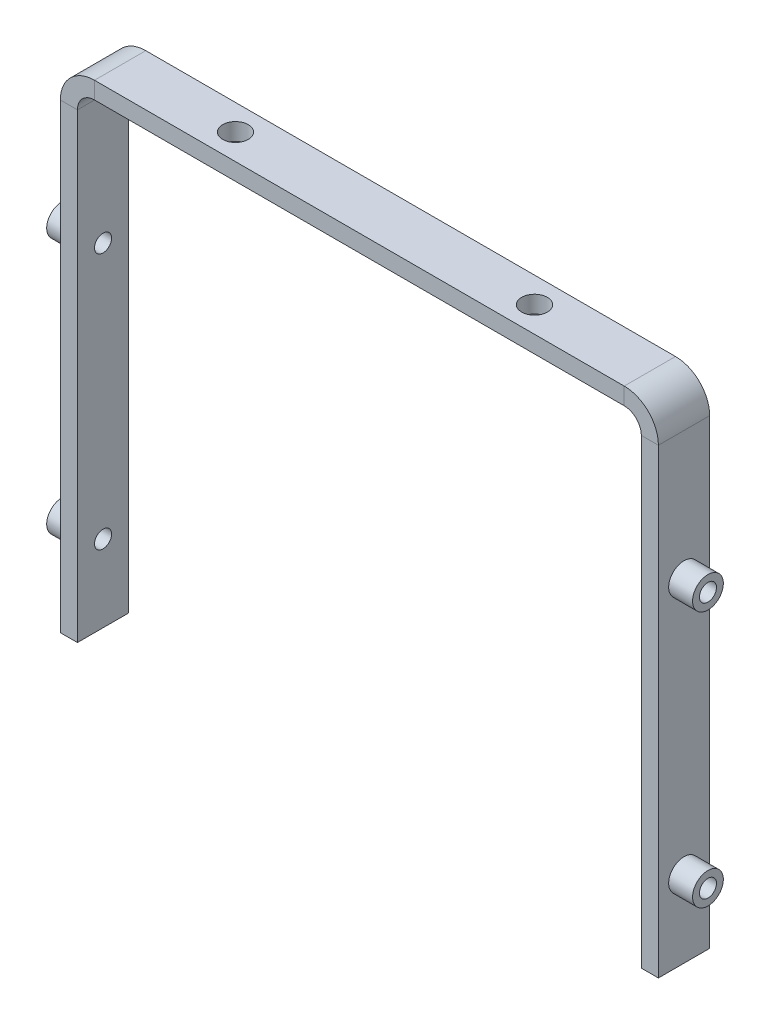
ISO-10303-21;
HEADER;
FILE_DESCRIPTION(('STEP AP214'),'2;1');
FILE_NAME('part.step','',(''),(''),'','','');
FILE_SCHEMA(('AUTOMOTIVE_DESIGN { 1 0 10303 214 1 1 1 1 }'));
ENDSEC;
DATA;
#1=APPLICATION_CONTEXT('core data for automotive mechanical design processes');
#2=APPLICATION_PROTOCOL_DEFINITION('international standard','automotive_design',2000,#1);
#3=PRODUCT_CONTEXT('',#1,'mechanical');
#4=PRODUCT('Part','Part','',(#3));
#5=PRODUCT_RELATED_PRODUCT_CATEGORY('part','',(#4));
#6=PRODUCT_DEFINITION_FORMATION('','',#4);
#7=PRODUCT_DEFINITION_CONTEXT('part definition',#1,'design');
#8=PRODUCT_DEFINITION('design','',#6,#7);
#9=PRODUCT_DEFINITION_SHAPE('','',#8);
#10=(LENGTH_UNIT() NAMED_UNIT(*) SI_UNIT(.MILLI.,.METRE.));
#11=(NAMED_UNIT(*) PLANE_ANGLE_UNIT() SI_UNIT($,.RADIAN.));
#12=(NAMED_UNIT(*) SI_UNIT($,.STERADIAN.) SOLID_ANGLE_UNIT());
#13=UNCERTAINTY_MEASURE_WITH_UNIT(LENGTH_MEASURE(1.E-05),#10,'distance_accuracy_value','');
#14=(GEOMETRIC_REPRESENTATION_CONTEXT(3) GLOBAL_UNCERTAINTY_ASSIGNED_CONTEXT((#13)) GLOBAL_UNIT_ASSIGNED_CONTEXT((#10,
#11,#12)) REPRESENTATION_CONTEXT('',''));
#15=CARTESIAN_POINT('',(0.,0.,0.));
#16=DIRECTION('',(0.,0.,1.));
#17=DIRECTION('',(1.,0.,0.));
#18=AXIS2_PLACEMENT_3D('',#15,#16,#17);
#19=CARTESIAN_POINT('',(175.,-280.,15.));
#20=DIRECTION('',(1.,0.,0.));
#21=DIRECTION('',(0.,1.,0.));
#22=AXIS2_PLACEMENT_3D('',#19,#20,#21);
#23=PLANE('',#22);
#24=CARTESIAN_POINT('',(175.,-235.,0.));
#25=DIRECTION('',(1.,0.,0.));
#26=DIRECTION('',(0.,1.,0.));
#27=AXIS2_PLACEMENT_3D('',#24,#25,#26);
#28=CIRCLE('',#27,9.00000000000001);
#29=CARTESIAN_POINT('',(175.,-226.,0.));
#30=VERTEX_POINT('',#29);
#31=EDGE_CURVE('E393',#30,#30,#28,.T.);
#32=ORIENTED_EDGE('',*,*,#31,.F.);
#33=EDGE_LOOP('',(#32));
#34=FACE_BOUND('',#33,.T.);
#35=DIRECTION('',(0.,1.,0.));
#36=VECTOR('',#35,1.);
#37=CARTESIAN_POINT('',(175.,-280.,-15.));
#38=LINE('',#37,#36);
#39=CARTESIAN_POINT('',(175.,-9.99999999999998,-15.));
#40=VERTEX_POINT('',#39);
#41=CARTESIAN_POINT('',(175.,-280.,-15.));
#42=VERTEX_POINT('',#41);
#43=EDGE_CURVE('E119',#40,#42,#38,.F.);
#44=ORIENTED_EDGE('',*,*,#43,.F.);
#45=DIRECTION('',(0.,0.,1.));
#46=VECTOR('',#45,1.);
#47=CARTESIAN_POINT('',(175.,-9.99999999999995,15.));
#48=LINE('',#47,#46);
#49=CARTESIAN_POINT('',(175.,-9.99999999999995,15.));
#50=VERTEX_POINT('',#49);
#51=EDGE_CURVE('E214',#50,#40,#48,.F.);
#52=ORIENTED_EDGE('',*,*,#51,.F.);
#53=DIRECTION('',(0.,1.,0.));
#54=VECTOR('',#53,1.);
#55=CARTESIAN_POINT('',(175.,-280.,15.));
#56=LINE('',#55,#54);
#57=CARTESIAN_POINT('',(175.,-280.,15.));
#58=VERTEX_POINT('',#57);
#59=EDGE_CURVE('E121',#50,#58,#56,.F.);
#60=ORIENTED_EDGE('',*,*,#59,.T.);
#61=DIRECTION('',(0.,0.,1.));
#62=VECTOR('',#61,1.);
#63=CARTESIAN_POINT('',(175.,-280.,15.));
#64=LINE('',#63,#62);
#65=EDGE_CURVE('E104',#58,#42,#64,.F.);
#66=ORIENTED_EDGE('',*,*,#65,.T.);
#67=EDGE_LOOP('',(#44,#52,#60,#66));
#68=FACE_BOUND('',#67,.T.);
#69=CARTESIAN_POINT('',(175.,-84.9999999999999,0.));
#70=DIRECTION('',(1.,0.,0.));
#71=DIRECTION('',(0.,1.,0.));
#72=AXIS2_PLACEMENT_3D('',#69,#70,#71);
#73=CIRCLE('',#72,9.00000000000001);
#74=CARTESIAN_POINT('',(175.,-75.9999999999999,0.));
#75=VERTEX_POINT('',#74);
#76=EDGE_CURVE('E384',#75,#75,#73,.T.);
#77=ORIENTED_EDGE('',*,*,#76,.F.);
#78=EDGE_LOOP('',(#77));
#79=FACE_BOUND('',#78,.T.);
#80=ADVANCED_FACE('F41',(#34,#68,#79),#23,.T.);
#81=CARTESIAN_POINT('',(165.,-280.,15.));
#82=DIRECTION('',(0.,-1.,0.));
#83=DIRECTION('',(0.,0.,-1.));
#84=AXIS2_PLACEMENT_3D('',#81,#82,#83);
#85=PLANE('',#84);
#86=DIRECTION('',(-1.,0.,0.));
#87=VECTOR('',#86,1.);
#88=CARTESIAN_POINT('',(165.,-280.,-15.));
#89=LINE('',#88,#87);
#90=CARTESIAN_POINT('',(165.,-280.,-15.));
#91=VERTEX_POINT('',#90);
#92=EDGE_CURVE('E100',#42,#91,#89,.T.);
#93=ORIENTED_EDGE('',*,*,#92,.F.);
#94=ORIENTED_EDGE('',*,*,#65,.F.);
#95=DIRECTION('',(-1.,0.,0.));
#96=VECTOR('',#95,1.);
#97=CARTESIAN_POINT('',(165.,-280.,15.));
#98=LINE('',#97,#96);
#99=CARTESIAN_POINT('',(165.,-280.,15.));
#100=VERTEX_POINT('',#99);
#101=EDGE_CURVE('E112',#58,#100,#98,.T.);
#102=ORIENTED_EDGE('',*,*,#101,.T.);
#103=DIRECTION('',(0.,0.,-1.));
#104=VECTOR('',#103,1.);
#105=CARTESIAN_POINT('',(165.,-280.,15.));
#106=LINE('',#105,#104);
#107=EDGE_CURVE('E107',#100,#91,#106,.T.);
#108=ORIENTED_EDGE('',*,*,#107,.T.);
#109=EDGE_LOOP('',(#93,#94,#102,#108));
#110=FACE_BOUND('',#109,.T.);
#111=ADVANCED_FACE('F102',(#110),#85,.T.);
#112=CARTESIAN_POINT('',(165.,-280.,15.));
#113=DIRECTION('',(0.,0.,1.));
#114=DIRECTION('',(0.,-1.,0.));
#115=AXIS2_PLACEMENT_3D('',#112,#113,#114);
#116=PLANE('',#115);
#117=ORIENTED_EDGE('',*,*,#101,.F.);
#118=ORIENTED_EDGE('',*,*,#59,.F.);
#119=DIRECTION('',(-1.,0.,0.));
#120=VECTOR('',#119,1.);
#121=CARTESIAN_POINT('',(165.,-9.99999999999998,15.));
#122=LINE('',#121,#120);
#123=CARTESIAN_POINT('',(165.,-9.99999999999998,15.));
#124=VERTEX_POINT('',#123);
#125=EDGE_CURVE('E164',#50,#124,#122,.T.);
#126=ORIENTED_EDGE('',*,*,#125,.T.);
#127=DIRECTION('',(0.,-1.,0.));
#128=VECTOR('',#127,1.);
#129=CARTESIAN_POINT('',(165.,-280.,15.));
#130=LINE('',#129,#128);
#131=EDGE_CURVE('E276',#124,#100,#130,.T.);
#132=ORIENTED_EDGE('',*,*,#131,.T.);
#133=EDGE_LOOP('',(#117,#118,#126,#132));
#134=FACE_BOUND('',#133,.T.);
#135=ADVANCED_FACE('F279',(#134),#116,.T.);
#136=CARTESIAN_POINT('',(155.,-9.99999999999998,15.));
#137=DIRECTION('',(0.,0.,1.));
#138=DIRECTION('',(1.,0.,0.));
#139=AXIS2_PLACEMENT_3D('',#136,#137,#138);
#140=PLANE('',#139);
#141=ORIENTED_EDGE('',*,*,#125,.F.);
#142=CARTESIAN_POINT('',(155.,-9.99999999999998,15.));
#143=DIRECTION('',(0.,0.,-1.));
#144=DIRECTION('',(-1.,0.,0.));
#145=AXIS2_PLACEMENT_3D('',#142,#143,#144);
#146=CIRCLE('',#145,20.);
#147=CARTESIAN_POINT('',(155.,9.99999999999996,15.));
#148=VERTEX_POINT('',#147);
#149=EDGE_CURVE('E210',#148,#50,#146,.T.);
#150=ORIENTED_EDGE('',*,*,#149,.F.);
#151=DIRECTION('',(0.,-1.,0.));
#152=VECTOR('',#151,1.);
#153=CARTESIAN_POINT('',(155.,0.,15.));
#154=LINE('',#153,#152);
#155=CARTESIAN_POINT('',(155.,0.,15.));
#156=VERTEX_POINT('',#155);
#157=EDGE_CURVE('E161',#148,#156,#154,.T.);
#158=ORIENTED_EDGE('',*,*,#157,.T.);
#159=CARTESIAN_POINT('',(155.,-9.99999999999998,15.));
#160=DIRECTION('',(0.,0.,-1.));
#161=DIRECTION('',(1.,0.,0.));
#162=AXIS2_PLACEMENT_3D('',#159,#160,#161);
#163=CIRCLE('',#162,10.);
#164=EDGE_CURVE('E167',#156,#124,#163,.T.);
#165=ORIENTED_EDGE('',*,*,#164,.T.);
#166=EDGE_LOOP('',(#141,#150,#158,#165));
#167=FACE_BOUND('',#166,.T.);
#168=ADVANCED_FACE('F253',(#167),#140,.T.);
#169=CARTESIAN_POINT('',(155.,0.,15.));
#170=DIRECTION('',(0.,0.,1.));
#171=DIRECTION('',(1.,0.,0.));
#172=AXIS2_PLACEMENT_3D('',#169,#170,#171);
#173=PLANE('',#172);
#174=ORIENTED_EDGE('',*,*,#157,.F.);
#175=DIRECTION('',(-1.,0.,0.));
#176=VECTOR('',#175,1.);
#177=CARTESIAN_POINT('',(155.,9.99999999999996,15.));
#178=LINE('',#177,#176);
#179=CARTESIAN_POINT('',(-155.,9.99999999999998,15.));
#180=VERTEX_POINT('',#179);
#181=EDGE_CURVE('E206',#180,#148,#178,.F.);
#182=ORIENTED_EDGE('',*,*,#181,.F.);
#183=DIRECTION('',(0.,-1.,0.));
#184=VECTOR('',#183,1.);
#185=CARTESIAN_POINT('',(-155.,0.,15.));
#186=LINE('',#185,#184);
#187=CARTESIAN_POINT('',(-155.,0.,15.));
#188=VERTEX_POINT('',#187);
#189=EDGE_CURVE('E158',#180,#188,#186,.T.);
#190=ORIENTED_EDGE('',*,*,#189,.T.);
#191=DIRECTION('',(1.,0.,0.));
#192=VECTOR('',#191,1.);
#193=CARTESIAN_POINT('',(155.,0.,15.));
#194=LINE('',#193,#192);
#195=EDGE_CURVE('E407',#188,#156,#194,.T.);
#196=ORIENTED_EDGE('',*,*,#195,.T.);
#197=EDGE_LOOP('',(#174,#182,#190,#196));
#198=FACE_BOUND('',#197,.T.);
#199=ADVANCED_FACE('F247',(#198),#173,.T.);
#200=CARTESIAN_POINT('',(-155.,-10.,15.));
#201=DIRECTION('',(0.,0.,1.));
#202=DIRECTION('',(1.,0.,0.));
#203=AXIS2_PLACEMENT_3D('',#200,#201,#202);
#204=PLANE('',#203);
#205=ORIENTED_EDGE('',*,*,#189,.F.);
#206=CARTESIAN_POINT('',(-155.,-10.,15.));
#207=DIRECTION('',(0.,0.,-1.));
#208=DIRECTION('',(-1.,0.,0.));
#209=AXIS2_PLACEMENT_3D('',#206,#207,#208);
#210=CIRCLE('',#209,20.);
#211=CARTESIAN_POINT('',(-175.,-10.,15.));
#212=VERTEX_POINT('',#211);
#213=EDGE_CURVE('E125',#212,#180,#210,.T.);
#214=ORIENTED_EDGE('',*,*,#213,.F.);
#215=DIRECTION('',(1.,0.,0.));
#216=VECTOR('',#215,1.);
#217=CARTESIAN_POINT('',(-165.,-10.,15.));
#218=LINE('',#217,#216);
#219=CARTESIAN_POINT('',(-165.,-10.,15.));
#220=VERTEX_POINT('',#219);
#221=EDGE_CURVE('E155',#212,#220,#218,.T.);
#222=ORIENTED_EDGE('',*,*,#221,.T.);
#223=CARTESIAN_POINT('',(-155.,-10.,15.));
#224=DIRECTION('',(0.,0.,-1.));
#225=DIRECTION('',(-1.,0.,0.));
#226=AXIS2_PLACEMENT_3D('',#223,#224,#225);
#227=CIRCLE('',#226,9.99999999999998);
#228=EDGE_CURVE('E429',#220,#188,#227,.T.);
#229=ORIENTED_EDGE('',*,*,#228,.T.);
#230=EDGE_LOOP('',(#205,#214,#222,#229));
#231=FACE_BOUND('',#230,.T.);
#232=ADVANCED_FACE('F333',(#231),#204,.T.);
#233=CARTESIAN_POINT('',(-165.,-280.,15.));
#234=DIRECTION('',(0.,0.,1.));
#235=DIRECTION('',(0.,1.,0.));
#236=AXIS2_PLACEMENT_3D('',#233,#234,#235);
#237=PLANE('',#236);
#238=ORIENTED_EDGE('',*,*,#221,.F.);
#239=DIRECTION('',(0.,-1.,0.));
#240=VECTOR('',#239,1.);
#241=CARTESIAN_POINT('',(-175.,-280.,15.));
#242=LINE('',#241,#240);
#243=CARTESIAN_POINT('',(-175.,-280.,15.));
#244=VERTEX_POINT('',#243);
#245=EDGE_CURVE('E200',#244,#212,#242,.F.);
#246=ORIENTED_EDGE('',*,*,#245,.F.);
#247=DIRECTION('',(1.,0.,0.));
#248=VECTOR('',#247,1.);
#249=CARTESIAN_POINT('',(-165.,-280.,15.));
#250=LINE('',#249,#248);
#251=CARTESIAN_POINT('',(-165.,-280.,15.));
#252=VERTEX_POINT('',#251);
#253=EDGE_CURVE('E152',#244,#252,#250,.T.);
#254=ORIENTED_EDGE('',*,*,#253,.T.);
#255=DIRECTION('',(0.,1.,0.));
#256=VECTOR('',#255,1.);
#257=CARTESIAN_POINT('',(-165.,-280.,15.));
#258=LINE('',#257,#256);
#259=EDGE_CURVE('E422',#252,#220,#258,.T.);
#260=ORIENTED_EDGE('',*,*,#259,.T.);
#261=EDGE_LOOP('',(#238,#246,#254,#260));
#262=FACE_BOUND('',#261,.T.);
#263=ADVANCED_FACE('F330',(#262),#237,.T.);
#264=CARTESIAN_POINT('',(-165.,-280.,15.));
#265=DIRECTION('',(0.,1.,0.));
#266=DIRECTION('',(0.,0.,-1.));
#267=AXIS2_PLACEMENT_3D('',#264,#265,#266);
#268=PLANE('',#267);
#269=ORIENTED_EDGE('',*,*,#253,.F.);
#270=DIRECTION('',(0.,0.,1.));
#271=VECTOR('',#270,1.);
#272=CARTESIAN_POINT('',(-175.,-280.,15.));
#273=LINE('',#272,#271);
#274=CARTESIAN_POINT('',(-175.,-280.,-15.));
#275=VERTEX_POINT('',#274);
#276=EDGE_CURVE('E187',#244,#275,#273,.F.);
#277=ORIENTED_EDGE('',*,*,#276,.T.);
#278=DIRECTION('',(1.,0.,0.));
#279=VECTOR('',#278,1.);
#280=CARTESIAN_POINT('',(-165.,-280.,-15.));
#281=LINE('',#280,#279);
#282=CARTESIAN_POINT('',(-165.,-280.,-15.));
#283=VERTEX_POINT('',#282);
#284=EDGE_CURVE('E149',#275,#283,#281,.T.);
#285=ORIENTED_EDGE('',*,*,#284,.T.);
#286=DIRECTION('',(0.,0.,-1.));
#287=VECTOR('',#286,1.);
#288=CARTESIAN_POINT('',(-165.,-280.,15.));
#289=LINE('',#288,#287);
#290=EDGE_CURVE('E425',#252,#283,#289,.T.);
#291=ORIENTED_EDGE('',*,*,#290,.F.);
#292=EDGE_LOOP('',(#269,#277,#285,#291));
#293=FACE_BOUND('',#292,.T.);
#294=ADVANCED_FACE('F196',(#293),#268,.F.);
#295=CARTESIAN_POINT('',(-165.,-280.,-15.));
#296=DIRECTION('',(0.,0.,1.));
#297=DIRECTION('',(0.,1.,0.));
#298=AXIS2_PLACEMENT_3D('',#295,#296,#297);
#299=PLANE('',#298);
#300=ORIENTED_EDGE('',*,*,#284,.F.);
#301=DIRECTION('',(0.,-1.,0.));
#302=VECTOR('',#301,1.);
#303=CARTESIAN_POINT('',(-175.,-280.,-15.));
#304=LINE('',#303,#302);
#305=CARTESIAN_POINT('',(-175.,-10.,-15.));
#306=VERTEX_POINT('',#305);
#307=EDGE_CURVE('E184',#275,#306,#304,.F.);
#308=ORIENTED_EDGE('',*,*,#307,.T.);
#309=DIRECTION('',(1.,0.,0.));
#310=VECTOR('',#309,1.);
#311=CARTESIAN_POINT('',(-165.,-10.,-15.));
#312=LINE('',#311,#310);
#313=CARTESIAN_POINT('',(-165.,-10.,-15.));
#314=VERTEX_POINT('',#313);
#315=EDGE_CURVE('E146',#306,#314,#312,.T.);
#316=ORIENTED_EDGE('',*,*,#315,.T.);
#317=DIRECTION('',(0.,1.,0.));
#318=VECTOR('',#317,1.);
#319=CARTESIAN_POINT('',(-165.,-280.,-15.));
#320=LINE('',#319,#318);
#321=EDGE_CURVE('E416',#283,#314,#320,.T.);
#322=ORIENTED_EDGE('',*,*,#321,.F.);
#323=EDGE_LOOP('',(#300,#308,#316,#322));
#324=FACE_BOUND('',#323,.T.);
#325=ADVANCED_FACE('F325',(#324),#299,.F.);
#326=CARTESIAN_POINT('',(-155.,-10.,-15.));
#327=DIRECTION('',(0.,0.,1.));
#328=DIRECTION('',(1.,0.,0.));
#329=AXIS2_PLACEMENT_3D('',#326,#327,#328);
#330=PLANE('',#329);
#331=ORIENTED_EDGE('',*,*,#315,.F.);
#332=CARTESIAN_POINT('',(-155.,-10.,-15.));
#333=DIRECTION('',(0.,0.,-1.));
#334=DIRECTION('',(-1.,0.,0.));
#335=AXIS2_PLACEMENT_3D('',#332,#333,#334);
#336=CIRCLE('',#335,20.);
#337=CARTESIAN_POINT('',(-155.,9.99999999999996,-15.));
#338=VERTEX_POINT('',#337);
#339=EDGE_CURVE('E128',#306,#338,#336,.T.);
#340=ORIENTED_EDGE('',*,*,#339,.T.);
#341=DIRECTION('',(0.,-1.,0.));
#342=VECTOR('',#341,1.);
#343=CARTESIAN_POINT('',(-155.,0.,-15.));
#344=LINE('',#343,#342);
#345=CARTESIAN_POINT('',(-155.,0.,-15.));
#346=VERTEX_POINT('',#345);
#347=EDGE_CURVE('E143',#338,#346,#344,.T.);
#348=ORIENTED_EDGE('',*,*,#347,.T.);
#349=CARTESIAN_POINT('',(-155.,-10.,-15.));
#350=DIRECTION('',(0.,0.,-1.));
#351=DIRECTION('',(-1.,0.,0.));
#352=AXIS2_PLACEMENT_3D('',#349,#350,#351);
#353=CIRCLE('',#352,9.99999999999998);
#354=EDGE_CURVE('E427',#314,#346,#353,.T.);
#355=ORIENTED_EDGE('',*,*,#354,.F.);
#356=EDGE_LOOP('',(#331,#340,#348,#355));
#357=FACE_BOUND('',#356,.T.);
#358=ADVANCED_FACE('F238',(#357),#330,.F.);
#359=CARTESIAN_POINT('',(155.,0.,-15.));
#360=DIRECTION('',(0.,0.,1.));
#361=DIRECTION('',(1.,0.,0.));
#362=AXIS2_PLACEMENT_3D('',#359,#360,#361);
#363=PLANE('',#362);
#364=ORIENTED_EDGE('',*,*,#347,.F.);
#365=DIRECTION('',(-1.,0.,0.));
#366=VECTOR('',#365,1.);
#367=CARTESIAN_POINT('',(155.,9.99999999999996,-15.));
#368=LINE('',#367,#366);
#369=CARTESIAN_POINT('',(155.,9.99999999999996,-15.));
#370=VERTEX_POINT('',#369);
#371=EDGE_CURVE('E139',#338,#370,#368,.F.);
#372=ORIENTED_EDGE('',*,*,#371,.T.);
#373=DIRECTION('',(0.,-1.,0.));
#374=VECTOR('',#373,1.);
#375=CARTESIAN_POINT('',(155.,0.,-15.));
#376=LINE('',#375,#374);
#377=CARTESIAN_POINT('',(155.,0.,-15.));
#378=VERTEX_POINT('',#377);
#379=EDGE_CURVE('E140',#370,#378,#376,.T.);
#380=ORIENTED_EDGE('',*,*,#379,.T.);
#381=DIRECTION('',(1.,0.,0.));
#382=VECTOR('',#381,1.);
#383=CARTESIAN_POINT('',(155.,0.,-15.));
#384=LINE('',#383,#382);
#385=EDGE_CURVE('E403',#346,#378,#384,.T.);
#386=ORIENTED_EDGE('',*,*,#385,.F.);
#387=EDGE_LOOP('',(#364,#372,#380,#386));
#388=FACE_BOUND('',#387,.T.);
#389=ADVANCED_FACE('F230',(#388),#363,.F.);
#390=CARTESIAN_POINT('',(155.,-9.99999999999998,-15.));
#391=DIRECTION('',(0.,0.,1.));
#392=DIRECTION('',(1.,0.,0.));
#393=AXIS2_PLACEMENT_3D('',#390,#391,#392);
#394=PLANE('',#393);
#395=ORIENTED_EDGE('',*,*,#379,.F.);
#396=CARTESIAN_POINT('',(155.,-9.99999999999998,-15.));
#397=DIRECTION('',(0.,0.,-1.));
#398=DIRECTION('',(-1.,0.,0.));
#399=AXIS2_PLACEMENT_3D('',#396,#397,#398);
#400=CIRCLE('',#399,20.);
#401=EDGE_CURVE('E213',#370,#40,#400,.T.);
#402=ORIENTED_EDGE('',*,*,#401,.T.);
#403=DIRECTION('',(-1.,0.,0.));
#404=VECTOR('',#403,1.);
#405=CARTESIAN_POINT('',(165.,-9.99999999999998,-15.));
#406=LINE('',#405,#404);
#407=CARTESIAN_POINT('',(165.,-9.99999999999998,-15.));
#408=VERTEX_POINT('',#407);
#409=EDGE_CURVE('E58',#40,#408,#406,.T.);
#410=ORIENTED_EDGE('',*,*,#409,.T.);
#411=CARTESIAN_POINT('',(155.,-9.99999999999998,-15.));
#412=DIRECTION('',(0.,0.,-1.));
#413=DIRECTION('',(1.,0.,0.));
#414=AXIS2_PLACEMENT_3D('',#411,#412,#413);
#415=CIRCLE('',#414,10.);
#416=EDGE_CURVE('E282',#378,#408,#415,.T.);
#417=ORIENTED_EDGE('',*,*,#416,.F.);
#418=EDGE_LOOP('',(#395,#402,#410,#417));
#419=FACE_BOUND('',#418,.T.);
#420=ADVANCED_FACE('F257',(#419),#394,.F.);
#421=CARTESIAN_POINT('',(-87.5,0.,0.));
#422=DIRECTION('',(0.,1.,0.));
#423=DIRECTION('',(-1.,0.,0.));
#424=AXIS2_PLACEMENT_3D('',#421,#422,#423);
#425=CYLINDRICAL_SURFACE('',#424,7.50000000000001);
#426=CARTESIAN_POINT('',(-87.5,0.,0.));
#427=DIRECTION('',(0.,1.,0.));
#428=DIRECTION('',(-1.,0.,0.));
#429=AXIS2_PLACEMENT_3D('',#426,#427,#428);
#430=CIRCLE('',#429,7.50000000000001);
#431=CARTESIAN_POINT('',(-95.,0.,0.));
#432=VERTEX_POINT('',#431);
#433=EDGE_CURVE('E212',#432,#432,#430,.F.);
#434=ORIENTED_EDGE('',*,*,#433,.T.);
#435=EDGE_LOOP('',(#434));
#436=FACE_BOUND('',#435,.T.);
#437=CARTESIAN_POINT('',(-87.5,9.99999999999994,0.));
#438=DIRECTION('',(0.,1.,0.));
#439=DIRECTION('',(-1.,0.,0.));
#440=AXIS2_PLACEMENT_3D('',#437,#438,#439);
#441=CIRCLE('',#440,7.50000000000001);
#442=CARTESIAN_POINT('',(-95.,9.99999999999994,0.));
#443=VERTEX_POINT('',#442);
#444=EDGE_CURVE('E132',#443,#443,#441,.F.);
#445=ORIENTED_EDGE('',*,*,#444,.F.);
#446=EDGE_LOOP('',(#445));
#447=FACE_BOUND('',#446,.T.);
#448=ADVANCED_FACE('F320',(#436,#447),#425,.F.);
#449=CARTESIAN_POINT('',(87.5,0.,0.));
#450=DIRECTION('',(0.,1.,0.));
#451=DIRECTION('',(-1.,0.,0.));
#452=AXIS2_PLACEMENT_3D('',#449,#450,#451);
#453=CYLINDRICAL_SURFACE('',#452,7.5);
#454=CARTESIAN_POINT('',(87.5,0.,0.));
#455=DIRECTION('',(0.,1.,0.));
#456=DIRECTION('',(-1.,0.,0.));
#457=AXIS2_PLACEMENT_3D('',#454,#455,#456);
#458=CIRCLE('',#457,7.5);
#459=CARTESIAN_POINT('',(80.,0.,0.));
#460=VERTEX_POINT('',#459);
#461=EDGE_CURVE('E400',#460,#460,#458,.F.);
#462=ORIENTED_EDGE('',*,*,#461,.T.);
#463=EDGE_LOOP('',(#462));
#464=FACE_BOUND('',#463,.T.);
#465=CARTESIAN_POINT('',(87.5,9.99999999999994,0.));
#466=DIRECTION('',(0.,1.,0.));
#467=DIRECTION('',(-1.,0.,0.));
#468=AXIS2_PLACEMENT_3D('',#465,#466,#467);
#469=CIRCLE('',#468,7.5);
#470=CARTESIAN_POINT('',(80.,9.99999999999994,0.));
#471=VERTEX_POINT('',#470);
#472=EDGE_CURVE('E135',#471,#471,#469,.F.);
#473=ORIENTED_EDGE('',*,*,#472,.F.);
#474=EDGE_LOOP('',(#473));
#475=FACE_BOUND('',#474,.T.);
#476=ADVANCED_FACE('F352',(#464,#475),#453,.F.);
#477=CARTESIAN_POINT('',(-165.,-235.,0.));
#478=DIRECTION('',(-1.,0.,0.));
#479=DIRECTION('',(0.,-1.,0.));
#480=AXIS2_PLACEMENT_3D('',#477,#478,#479);
#481=CYLINDRICAL_SURFACE('',#480,5.);
#482=CARTESIAN_POINT('',(-165.,-235.,0.));
#483=DIRECTION('',(-1.,0.,0.));
#484=DIRECTION('',(0.,-1.,0.));
#485=AXIS2_PLACEMENT_3D('',#482,#483,#484);
#486=CIRCLE('',#485,5.);
#487=CARTESIAN_POINT('',(-165.,-240.,0.));
#488=VERTEX_POINT('',#487);
#489=EDGE_CURVE('E366',#488,#488,#486,.T.);
#490=ORIENTED_EDGE('',*,*,#489,.F.);
#491=EDGE_LOOP('',(#490));
#492=FACE_BOUND('',#491,.T.);
#493=CARTESIAN_POINT('',(-189.,-235.,0.));
#494=DIRECTION('',(1.,0.,0.));
#495=DIRECTION('',(0.,1.,0.));
#496=AXIS2_PLACEMENT_3D('',#493,#494,#495);
#497=CIRCLE('',#496,5.);
#498=CARTESIAN_POINT('',(-189.,-230.,0.));
#499=VERTEX_POINT('',#498);
#500=EDGE_CURVE('E369',#499,#499,#497,.T.);
#501=ORIENTED_EDGE('',*,*,#500,.F.);
#502=EDGE_LOOP('',(#501));
#503=FACE_BOUND('',#502,.T.);
#504=ADVANCED_FACE('F355',(#492,#503),#481,.F.);
#505=CARTESIAN_POINT('',(-165.,-84.9999999999999,0.));
#506=DIRECTION('',(-1.,0.,0.));
#507=DIRECTION('',(0.,-1.,0.));
#508=AXIS2_PLACEMENT_3D('',#505,#506,#507);
#509=CYLINDRICAL_SURFACE('',#508,5.);
#510=CARTESIAN_POINT('',(-165.,-84.9999999999999,0.));
#511=DIRECTION('',(-1.,0.,0.));
#512=DIRECTION('',(0.,-1.,0.));
#513=AXIS2_PLACEMENT_3D('',#510,#511,#512);
#514=CIRCLE('',#513,5.);
#515=CARTESIAN_POINT('',(-165.,-89.9999999999999,0.));
#516=VERTEX_POINT('',#515);
#517=EDGE_CURVE('E413',#516,#516,#514,.T.);
#518=ORIENTED_EDGE('',*,*,#517,.F.);
#519=EDGE_LOOP('',(#518));
#520=FACE_BOUND('',#519,.T.);
#521=CARTESIAN_POINT('',(-189.,-84.9999999999999,0.));
#522=DIRECTION('',(1.,0.,0.));
#523=DIRECTION('',(0.,1.,0.));
#524=AXIS2_PLACEMENT_3D('',#521,#522,#523);
#525=CIRCLE('',#524,5.);
#526=CARTESIAN_POINT('',(-189.,-79.9999999999999,0.));
#527=VERTEX_POINT('',#526);
#528=EDGE_CURVE('E378',#527,#527,#525,.T.);
#529=ORIENTED_EDGE('',*,*,#528,.F.);
#530=EDGE_LOOP('',(#529));
#531=FACE_BOUND('',#530,.T.);
#532=ADVANCED_FACE('F43',(#520,#531),#509,.F.);
#533=CARTESIAN_POINT('',(165.,-235.,0.));
#534=DIRECTION('',(1.,0.,0.));
#535=DIRECTION('',(0.,1.,0.));
#536=AXIS2_PLACEMENT_3D('',#533,#534,#535);
#537=CYLINDRICAL_SURFACE('',#536,5.);
#538=CARTESIAN_POINT('',(165.,-235.,0.));
#539=DIRECTION('',(1.,0.,0.));
#540=DIRECTION('',(0.,1.,0.));
#541=AXIS2_PLACEMENT_3D('',#538,#539,#540);
#542=CIRCLE('',#541,5.);
#543=CARTESIAN_POINT('',(165.,-230.,0.));
#544=VERTEX_POINT('',#543);
#545=EDGE_CURVE('E432',#544,#544,#542,.T.);
#546=ORIENTED_EDGE('',*,*,#545,.F.);
#547=EDGE_LOOP('',(#546));
#548=FACE_BOUND('',#547,.T.);
#549=CARTESIAN_POINT('',(189.,-235.,0.));
#550=DIRECTION('',(1.,0.,0.));
#551=DIRECTION('',(0.,1.,0.));
#552=AXIS2_PLACEMENT_3D('',#549,#550,#551);
#553=CIRCLE('',#552,5.);
#554=CARTESIAN_POINT('',(189.,-230.,0.));
#555=VERTEX_POINT('',#554);
#556=EDGE_CURVE('E388',#555,#555,#553,.T.);
#557=ORIENTED_EDGE('',*,*,#556,.T.);
#558=EDGE_LOOP('',(#557));
#559=FACE_BOUND('',#558,.T.);
#560=ADVANCED_FACE('F343',(#548,#559),#537,.F.);
#561=CARTESIAN_POINT('',(165.,-84.9999999999999,0.));
#562=DIRECTION('',(1.,0.,0.));
#563=DIRECTION('',(0.,1.,0.));
#564=AXIS2_PLACEMENT_3D('',#561,#562,#563);
#565=CYLINDRICAL_SURFACE('',#564,5.);
#566=CARTESIAN_POINT('',(165.,-84.9999999999999,0.));
#567=DIRECTION('',(1.,0.,0.));
#568=DIRECTION('',(0.,1.,0.));
#569=AXIS2_PLACEMENT_3D('',#566,#567,#568);
#570=CIRCLE('',#569,5.);
#571=CARTESIAN_POINT('',(165.,-79.9999999999999,0.));
#572=VERTEX_POINT('',#571);
#573=EDGE_CURVE('E435',#572,#572,#570,.T.);
#574=ORIENTED_EDGE('',*,*,#573,.F.);
#575=EDGE_LOOP('',(#574));
#576=FACE_BOUND('',#575,.T.);
#577=CARTESIAN_POINT('',(189.,-84.9999999999999,0.));
#578=DIRECTION('',(1.,0.,0.));
#579=DIRECTION('',(0.,1.,0.));
#580=AXIS2_PLACEMENT_3D('',#577,#578,#579);
#581=CIRCLE('',#580,5.);
#582=CARTESIAN_POINT('',(189.,-79.9999999999999,0.));
#583=VERTEX_POINT('',#582);
#584=EDGE_CURVE('E375',#583,#583,#581,.T.);
#585=ORIENTED_EDGE('',*,*,#584,.T.);
#586=EDGE_LOOP('',(#585));
#587=FACE_BOUND('',#586,.T.);
#588=ADVANCED_FACE('F300',(#576,#587),#565,.F.);
#589=CARTESIAN_POINT('',(165.,-280.,-15.));
#590=DIRECTION('',(0.,0.,1.));
#591=DIRECTION('',(0.,-1.,0.));
#592=AXIS2_PLACEMENT_3D('',#589,#590,#591);
#593=PLANE('',#592);
#594=ORIENTED_EDGE('',*,*,#43,.T.);
#595=ORIENTED_EDGE('',*,*,#92,.T.);
#596=DIRECTION('',(0.,-1.,0.));
#597=VECTOR('',#596,1.);
#598=CARTESIAN_POINT('',(165.,-280.,-15.));
#599=LINE('',#598,#597);
#600=EDGE_CURVE('E277',#408,#91,#599,.T.);
#601=ORIENTED_EDGE('',*,*,#600,.F.);
#602=ORIENTED_EDGE('',*,*,#409,.F.);
#603=EDGE_LOOP('',(#594,#595,#601,#602));
#604=FACE_BOUND('',#603,.T.);
#605=ADVANCED_FACE('F123',(#604),#593,.F.);
#606=CARTESIAN_POINT('',(155.,-9.99999999999998,15.));
#607=DIRECTION('',(0.,0.,-1.));
#608=DIRECTION('',(-1.,0.,0.));
#609=AXIS2_PLACEMENT_3D('',#606,#607,#608);
#610=CYLINDRICAL_SURFACE('',#609,10.);
#611=ORIENTED_EDGE('',*,*,#416,.T.);
#612=DIRECTION('',(0.,0.,-1.));
#613=VECTOR('',#612,1.);
#614=CARTESIAN_POINT('',(165.,-9.99999999999998,15.));
#615=LINE('',#614,#613);
#616=EDGE_CURVE('E280',#124,#408,#615,.T.);
#617=ORIENTED_EDGE('',*,*,#616,.F.);
#618=ORIENTED_EDGE('',*,*,#164,.F.);
#619=DIRECTION('',(0.,0.,-1.));
#620=VECTOR('',#619,1.);
#621=CARTESIAN_POINT('',(155.,0.,15.));
#622=LINE('',#621,#620);
#623=EDGE_CURVE('E405',#156,#378,#622,.T.);
#624=ORIENTED_EDGE('',*,*,#623,.T.);
#625=EDGE_LOOP('',(#611,#617,#618,#624));
#626=FACE_BOUND('',#625,.T.);
#627=ADVANCED_FACE('F290',(#626),#610,.F.);
#628=CARTESIAN_POINT('',(165.,-280.,15.));
#629=DIRECTION('',(1.,0.,0.));
#630=DIRECTION('',(0.,1.,0.));
#631=AXIS2_PLACEMENT_3D('',#628,#629,#630);
#632=PLANE('',#631);
#633=ORIENTED_EDGE('',*,*,#545,.T.);
#634=EDGE_LOOP('',(#633));
#635=FACE_BOUND('',#634,.T.);
#636=ORIENTED_EDGE('',*,*,#573,.T.);
#637=EDGE_LOOP('',(#636));
#638=FACE_BOUND('',#637,.T.);
#639=ORIENTED_EDGE('',*,*,#600,.T.);
#640=ORIENTED_EDGE('',*,*,#107,.F.);
#641=ORIENTED_EDGE('',*,*,#131,.F.);
#642=ORIENTED_EDGE('',*,*,#616,.T.);
#643=EDGE_LOOP('',(#639,#640,#641,#642));
#644=FACE_BOUND('',#643,.T.);
#645=ADVANCED_FACE('F274',(#635,#638,#644),#632,.F.);
#646=CARTESIAN_POINT('',(-155.,-10.,15.));
#647=DIRECTION('',(0.,0.,-1.));
#648=DIRECTION('',(-1.,0.,0.));
#649=AXIS2_PLACEMENT_3D('',#646,#647,#648);
#650=CYLINDRICAL_SURFACE('',#649,9.99999999999998);
#651=ORIENTED_EDGE('',*,*,#354,.T.);
#652=DIRECTION('',(0.,0.,-1.));
#653=VECTOR('',#652,1.);
#654=CARTESIAN_POINT('',(-155.,0.,15.));
#655=LINE('',#654,#653);
#656=EDGE_CURVE('E409',#188,#346,#655,.T.);
#657=ORIENTED_EDGE('',*,*,#656,.F.);
#658=ORIENTED_EDGE('',*,*,#228,.F.);
#659=DIRECTION('',(0.,0.,-1.));
#660=VECTOR('',#659,1.);
#661=CARTESIAN_POINT('',(-165.,-10.,15.));
#662=LINE('',#661,#660);
#663=EDGE_CURVE('E419',#220,#314,#662,.T.);
#664=ORIENTED_EDGE('',*,*,#663,.T.);
#665=EDGE_LOOP('',(#651,#657,#658,#664));
#666=FACE_BOUND('',#665,.T.);
#667=ADVANCED_FACE('F297',(#666),#650,.F.);
#668=CARTESIAN_POINT('',(-165.,-280.,15.));
#669=DIRECTION('',(-1.,0.,0.));
#670=DIRECTION('',(0.,-1.,0.));
#671=AXIS2_PLACEMENT_3D('',#668,#669,#670);
#672=PLANE('',#671);
#673=ORIENTED_EDGE('',*,*,#489,.T.);
#674=EDGE_LOOP('',(#673));
#675=FACE_BOUND('',#674,.T.);
#676=ORIENTED_EDGE('',*,*,#517,.T.);
#677=EDGE_LOOP('',(#676));
#678=FACE_BOUND('',#677,.T.);
#679=ORIENTED_EDGE('',*,*,#321,.T.);
#680=ORIENTED_EDGE('',*,*,#663,.F.);
#681=ORIENTED_EDGE('',*,*,#259,.F.);
#682=ORIENTED_EDGE('',*,*,#290,.T.);
#683=EDGE_LOOP('',(#679,#680,#681,#682));
#684=FACE_BOUND('',#683,.T.);
#685=ADVANCED_FACE('F465',(#675,#678,#684),#672,.F.);
#686=CARTESIAN_POINT('',(155.,0.,15.));
#687=DIRECTION('',(0.,1.,0.));
#688=DIRECTION('',(-1.,0.,0.));
#689=AXIS2_PLACEMENT_3D('',#686,#687,#688);
#690=PLANE('',#689);
#691=ORIENTED_EDGE('',*,*,#433,.F.);
#692=EDGE_LOOP('',(#691));
#693=FACE_BOUND('',#692,.T.);
#694=ORIENTED_EDGE('',*,*,#461,.F.);
#695=EDGE_LOOP('',(#694));
#696=FACE_BOUND('',#695,.T.);
#697=ORIENTED_EDGE('',*,*,#385,.T.);
#698=ORIENTED_EDGE('',*,*,#623,.F.);
#699=ORIENTED_EDGE('',*,*,#195,.F.);
#700=ORIENTED_EDGE('',*,*,#656,.T.);
#701=EDGE_LOOP('',(#697,#698,#699,#700));
#702=FACE_BOUND('',#701,.T.);
#703=ADVANCED_FACE('F462',(#693,#696,#702),#690,.F.);
#704=CARTESIAN_POINT('',(155.,-9.99999999999998,15.));
#705=DIRECTION('',(0.,0.,-1.));
#706=DIRECTION('',(-1.,0.,0.));
#707=AXIS2_PLACEMENT_3D('',#704,#705,#706);
#708=CYLINDRICAL_SURFACE('',#707,20.);
#709=ORIENTED_EDGE('',*,*,#401,.F.);
#710=DIRECTION('',(0.,0.,-1.));
#711=VECTOR('',#710,1.);
#712=CARTESIAN_POINT('',(155.,10.,15.));
#713=LINE('',#712,#711);
#714=EDGE_CURVE('E209',#148,#370,#713,.T.);
#715=ORIENTED_EDGE('',*,*,#714,.F.);
#716=ORIENTED_EDGE('',*,*,#149,.T.);
#717=ORIENTED_EDGE('',*,*,#51,.T.);
#718=EDGE_LOOP('',(#709,#715,#716,#717));
#719=FACE_BOUND('',#718,.T.);
#720=ADVANCED_FACE('F256',(#719),#708,.T.);
#721=CARTESIAN_POINT('',(-155.,-10.,15.));
#722=DIRECTION('',(0.,0.,-1.));
#723=DIRECTION('',(-1.,0.,0.));
#724=AXIS2_PLACEMENT_3D('',#721,#722,#723);
#725=CYLINDRICAL_SURFACE('',#724,20.);
#726=ORIENTED_EDGE('',*,*,#339,.F.);
#727=DIRECTION('',(0.,0.,-1.));
#728=VECTOR('',#727,1.);
#729=CARTESIAN_POINT('',(-175.,-10.,15.));
#730=LINE('',#729,#728);
#731=EDGE_CURVE('E190',#212,#306,#730,.T.);
#732=ORIENTED_EDGE('',*,*,#731,.F.);
#733=ORIENTED_EDGE('',*,*,#213,.T.);
#734=DIRECTION('',(0.,0.,1.));
#735=VECTOR('',#734,1.);
#736=CARTESIAN_POINT('',(-155.,9.99999999999998,15.));
#737=LINE('',#736,#735);
#738=EDGE_CURVE('E193',#180,#338,#737,.F.);
#739=ORIENTED_EDGE('',*,*,#738,.T.);
#740=EDGE_LOOP('',(#726,#732,#733,#739));
#741=FACE_BOUND('',#740,.T.);
#742=ADVANCED_FACE('F177',(#741),#725,.T.);
#743=CARTESIAN_POINT('',(-175.,-280.,15.));
#744=DIRECTION('',(-1.,0.,0.));
#745=DIRECTION('',(0.,-1.,0.));
#746=AXIS2_PLACEMENT_3D('',#743,#744,#745);
#747=PLANE('',#746);
#748=CARTESIAN_POINT('',(-175.,-84.9999999999999,0.));
#749=DIRECTION('',(-1.,0.,0.));
#750=DIRECTION('',(0.,-1.,0.));
#751=AXIS2_PLACEMENT_3D('',#748,#749,#750);
#752=CIRCLE('',#751,9.00000000000001);
#753=CARTESIAN_POINT('',(-175.,-93.9999999999999,0.));
#754=VERTEX_POINT('',#753);
#755=EDGE_CURVE('E11',#754,#754,#752,.T.);
#756=ORIENTED_EDGE('',*,*,#755,.F.);
#757=EDGE_LOOP('',(#756));
#758=FACE_BOUND('',#757,.T.);
#759=CARTESIAN_POINT('',(-175.,-235.,0.));
#760=DIRECTION('',(-1.,0.,0.));
#761=DIRECTION('',(0.,-1.,0.));
#762=AXIS2_PLACEMENT_3D('',#759,#760,#761);
#763=CIRCLE('',#762,9.00000000000001);
#764=CARTESIAN_POINT('',(-175.,-244.,0.));
#765=VERTEX_POINT('',#764);
#766=EDGE_CURVE('E50',#765,#765,#763,.T.);
#767=ORIENTED_EDGE('',*,*,#766,.F.);
#768=EDGE_LOOP('',(#767));
#769=FACE_BOUND('',#768,.T.);
#770=ORIENTED_EDGE('',*,*,#307,.F.);
#771=ORIENTED_EDGE('',*,*,#276,.F.);
#772=ORIENTED_EDGE('',*,*,#245,.T.);
#773=ORIENTED_EDGE('',*,*,#731,.T.);
#774=EDGE_LOOP('',(#770,#771,#772,#773));
#775=FACE_BOUND('',#774,.T.);
#776=ADVANCED_FACE('F173',(#758,#769,#775),#747,.T.);
#777=CARTESIAN_POINT('',(155.,9.99999999999996,15.));
#778=DIRECTION('',(0.,1.,0.));
#779=DIRECTION('',(-1.,0.,0.));
#780=AXIS2_PLACEMENT_3D('',#777,#778,#779);
#781=PLANE('',#780);
#782=ORIENTED_EDGE('',*,*,#444,.T.);
#783=EDGE_LOOP('',(#782));
#784=FACE_BOUND('',#783,.T.);
#785=ORIENTED_EDGE('',*,*,#472,.T.);
#786=EDGE_LOOP('',(#785));
#787=FACE_BOUND('',#786,.T.);
#788=ORIENTED_EDGE('',*,*,#371,.F.);
#789=ORIENTED_EDGE('',*,*,#738,.F.);
#790=ORIENTED_EDGE('',*,*,#181,.T.);
#791=ORIENTED_EDGE('',*,*,#714,.T.);
#792=EDGE_LOOP('',(#788,#789,#790,#791));
#793=FACE_BOUND('',#792,.T.);
#794=ADVANCED_FACE('F176',(#784,#787,#793),#781,.T.);
#795=CARTESIAN_POINT('',(189.,-235.,0.));
#796=DIRECTION('',(1.,0.,0.));
#797=DIRECTION('',(0.,1.,0.));
#798=AXIS2_PLACEMENT_3D('',#795,#796,#797);
#799=PLANE('',#798);
#800=CARTESIAN_POINT('',(189.,-235.,0.));
#801=DIRECTION('',(1.,0.,0.));
#802=DIRECTION('',(0.,1.,0.));
#803=AXIS2_PLACEMENT_3D('',#800,#801,#802);
#804=CIRCLE('',#803,9.00000000000001);
#805=CARTESIAN_POINT('',(189.,-226.,0.));
#806=VERTEX_POINT('',#805);
#807=EDGE_CURVE('E136',#806,#806,#804,.T.);
#808=ORIENTED_EDGE('',*,*,#807,.T.);
#809=EDGE_LOOP('',(#808));
#810=FACE_BOUND('',#809,.T.);
#811=ORIENTED_EDGE('',*,*,#556,.F.);
#812=EDGE_LOOP('',(#811));
#813=FACE_BOUND('',#812,.T.);
#814=ADVANCED_FACE('F316',(#810,#813),#799,.T.);
#815=CARTESIAN_POINT('',(189.,-235.,0.));
#816=DIRECTION('',(-1.,0.,0.));
#817=DIRECTION('',(0.,-1.,0.));
#818=AXIS2_PLACEMENT_3D('',#815,#816,#817);
#819=CYLINDRICAL_SURFACE('',#818,9.00000000000001);
#820=ORIENTED_EDGE('',*,*,#807,.F.);
#821=EDGE_LOOP('',(#820));
#822=FACE_BOUND('',#821,.T.);
#823=ORIENTED_EDGE('',*,*,#31,.T.);
#824=EDGE_LOOP('',(#823));
#825=FACE_BOUND('',#824,.T.);
#826=ADVANCED_FACE('F445',(#822,#825),#819,.T.);
#827=CARTESIAN_POINT('',(189.,-84.9999999999999,0.));
#828=DIRECTION('',(1.,0.,0.));
#829=DIRECTION('',(0.,1.,0.));
#830=AXIS2_PLACEMENT_3D('',#827,#828,#829);
#831=PLANE('',#830);
#832=CARTESIAN_POINT('',(189.,-84.9999999999999,0.));
#833=DIRECTION('',(1.,0.,0.));
#834=DIRECTION('',(0.,1.,0.));
#835=AXIS2_PLACEMENT_3D('',#832,#833,#834);
#836=CIRCLE('',#835,9.00000000000001);
#837=CARTESIAN_POINT('',(189.,-75.9999999999999,0.));
#838=VERTEX_POINT('',#837);
#839=EDGE_CURVE('E385',#838,#838,#836,.T.);
#840=ORIENTED_EDGE('',*,*,#839,.T.);
#841=EDGE_LOOP('',(#840));
#842=FACE_BOUND('',#841,.T.);
#843=ORIENTED_EDGE('',*,*,#584,.F.);
#844=EDGE_LOOP('',(#843));
#845=FACE_BOUND('',#844,.T.);
#846=ADVANCED_FACE('F442',(#842,#845),#831,.T.);
#847=CARTESIAN_POINT('',(189.,-84.9999999999999,0.));
#848=DIRECTION('',(-1.,0.,0.));
#849=DIRECTION('',(0.,-1.,0.));
#850=AXIS2_PLACEMENT_3D('',#847,#848,#849);
#851=CYLINDRICAL_SURFACE('',#850,9.00000000000001);
#852=ORIENTED_EDGE('',*,*,#839,.F.);
#853=EDGE_LOOP('',(#852));
#854=FACE_BOUND('',#853,.T.);
#855=ORIENTED_EDGE('',*,*,#76,.T.);
#856=EDGE_LOOP('',(#855));
#857=FACE_BOUND('',#856,.T.);
#858=ADVANCED_FACE('F444',(#854,#857),#851,.T.);
#859=CARTESIAN_POINT('',(-189.,-235.,0.));
#860=DIRECTION('',(1.,0.,0.));
#861=DIRECTION('',(0.,1.,0.));
#862=AXIS2_PLACEMENT_3D('',#859,#860,#861);
#863=CYLINDRICAL_SURFACE('',#862,9.00000000000001);
#864=CARTESIAN_POINT('',(-189.,-235.,0.));
#865=DIRECTION('',(1.,0.,0.));
#866=DIRECTION('',(0.,1.,0.));
#867=AXIS2_PLACEMENT_3D('',#864,#865,#866);
#868=CIRCLE('',#867,9.00000000000001);
#869=CARTESIAN_POINT('',(-189.,-226.,0.));
#870=VERTEX_POINT('',#869);
#871=EDGE_CURVE('E371',#870,#870,#868,.T.);
#872=ORIENTED_EDGE('',*,*,#871,.T.);
#873=EDGE_LOOP('',(#872));
#874=FACE_BOUND('',#873,.T.);
#875=ORIENTED_EDGE('',*,*,#766,.T.);
#876=EDGE_LOOP('',(#875));
#877=FACE_BOUND('',#876,.T.);
#878=ADVANCED_FACE('F171',(#874,#877),#863,.T.);
#879=CARTESIAN_POINT('',(-189.,-235.,0.));
#880=DIRECTION('',(-1.,0.,0.));
#881=DIRECTION('',(0.,1.,0.));
#882=AXIS2_PLACEMENT_3D('',#879,#880,#881);
#883=PLANE('',#882);
#884=ORIENTED_EDGE('',*,*,#500,.T.);
#885=EDGE_LOOP('',(#884));
#886=FACE_BOUND('',#885,.T.);
#887=ORIENTED_EDGE('',*,*,#871,.F.);
#888=EDGE_LOOP('',(#887));
#889=FACE_BOUND('',#888,.T.);
#890=ADVANCED_FACE('F780',(#886,#889),#883,.T.);
#891=CARTESIAN_POINT('',(-189.,-84.9999999999999,0.));
#892=DIRECTION('',(1.,0.,0.));
#893=DIRECTION('',(0.,1.,0.));
#894=AXIS2_PLACEMENT_3D('',#891,#892,#893);
#895=CYLINDRICAL_SURFACE('',#894,9.00000000000001);
#896=CARTESIAN_POINT('',(-189.,-84.9999999999999,0.));
#897=DIRECTION('',(1.,0.,0.));
#898=DIRECTION('',(0.,1.,0.));
#899=AXIS2_PLACEMENT_3D('',#896,#897,#898);
#900=CIRCLE('',#899,9.00000000000001);
#901=CARTESIAN_POINT('',(-189.,-75.9999999999999,0.));
#902=VERTEX_POINT('',#901);
#903=EDGE_CURVE('E372',#902,#902,#900,.T.);
#904=ORIENTED_EDGE('',*,*,#903,.T.);
#905=EDGE_LOOP('',(#904));
#906=FACE_BOUND('',#905,.T.);
#907=ORIENTED_EDGE('',*,*,#755,.T.);
#908=EDGE_LOOP('',(#907));
#909=FACE_BOUND('',#908,.T.);
#910=ADVANCED_FACE('F788',(#906,#909),#895,.T.);
#911=CARTESIAN_POINT('',(-189.,-84.9999999999999,0.));
#912=DIRECTION('',(-1.,0.,0.));
#913=DIRECTION('',(0.,1.,0.));
#914=AXIS2_PLACEMENT_3D('',#911,#912,#913);
#915=PLANE('',#914);
#916=ORIENTED_EDGE('',*,*,#528,.T.);
#917=EDGE_LOOP('',(#916));
#918=FACE_BOUND('',#917,.T.);
#919=ORIENTED_EDGE('',*,*,#903,.F.);
#920=EDGE_LOOP('',(#919));
#921=FACE_BOUND('',#920,.T.);
#922=ADVANCED_FACE('F795',(#918,#921),#915,.T.);
#923=CLOSED_SHELL('',(#80,#111,#135,#168,#199,#232,#263,#294,#325,#358,#389,#420,#448,#476,#504,
#532,#560,#588,#605,#627,#645,#667,#685,#703,#720,#742,#776,#794,#814,#826,#846,#858,#878,#890,
#910,#922));
#924=MANIFOLD_SOLID_BREP('B2',#923);
#925=ADVANCED_BREP_SHAPE_REPRESENTATION('',(#18,#924),#14);
#926=SHAPE_DEFINITION_REPRESENTATION(#9,#925);
ENDSEC;
END-ISO-10303-21;
